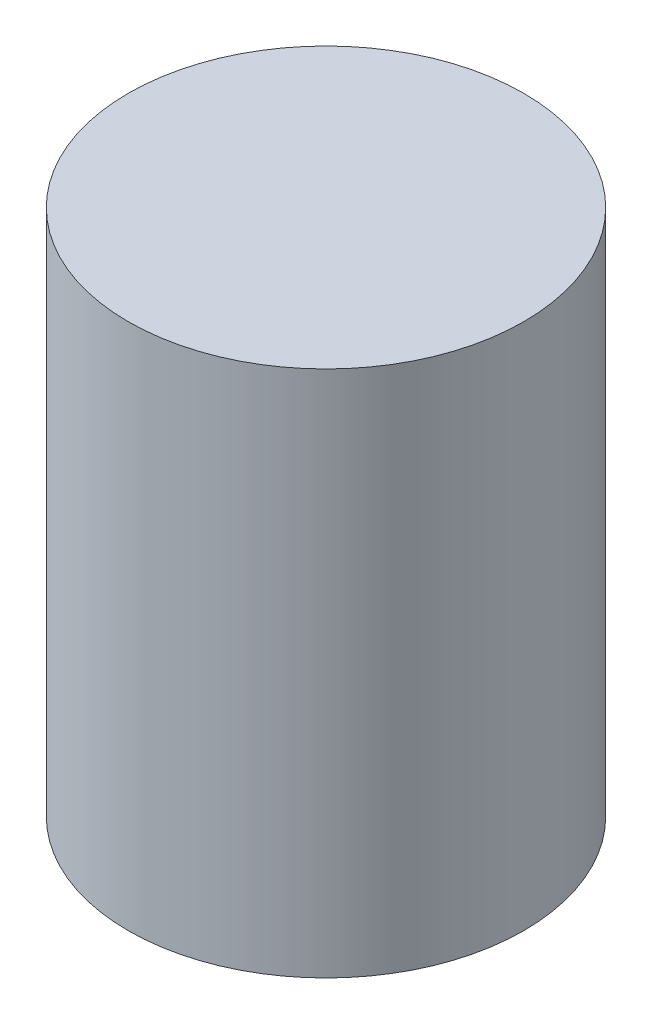
ISO-10303-21;
HEADER;
FILE_DESCRIPTION(('STEP AP214'),'2;1');
FILE_NAME('part.step','',(''),(''),'','','');
FILE_SCHEMA(('AUTOMOTIVE_DESIGN { 1 0 10303 214 1 1 1 1 }'));
ENDSEC;
DATA;
#1=APPLICATION_CONTEXT('core data for automotive mechanical design processes');
#2=APPLICATION_PROTOCOL_DEFINITION('international standard','automotive_design',2000,#1);
#3=PRODUCT_CONTEXT('',#1,'mechanical');
#4=PRODUCT('Part','Part','',(#3));
#5=PRODUCT_RELATED_PRODUCT_CATEGORY('part','',(#4));
#6=PRODUCT_DEFINITION_FORMATION('','',#4);
#7=PRODUCT_DEFINITION_CONTEXT('part definition',#1,'design');
#8=PRODUCT_DEFINITION('design','',#6,#7);
#9=PRODUCT_DEFINITION_SHAPE('','',#8);
#10=(LENGTH_UNIT() NAMED_UNIT(*) SI_UNIT(.MILLI.,.METRE.));
#11=(NAMED_UNIT(*) PLANE_ANGLE_UNIT() SI_UNIT($,.RADIAN.));
#12=(NAMED_UNIT(*) SI_UNIT($,.STERADIAN.) SOLID_ANGLE_UNIT());
#13=UNCERTAINTY_MEASURE_WITH_UNIT(LENGTH_MEASURE(1.E-05),#10,'distance_accuracy_value','');
#14=(GEOMETRIC_REPRESENTATION_CONTEXT(3) GLOBAL_UNCERTAINTY_ASSIGNED_CONTEXT((#13)) GLOBAL_UNIT_ASSIGNED_CONTEXT((#10,
#11,#12)) REPRESENTATION_CONTEXT('',''));
#15=CARTESIAN_POINT('',(0.,0.,0.));
#16=DIRECTION('',(0.,0.,1.));
#17=DIRECTION('',(1.,0.,0.));
#18=AXIS2_PLACEMENT_3D('',#15,#16,#17);
#19=CARTESIAN_POINT('',(0.,76.2,0.));
#20=DIRECTION('',(0.,-1.,0.));
#21=DIRECTION('',(0.,0.,-1.));
#22=AXIS2_PLACEMENT_3D('',#19,#20,#21);
#23=CYLINDRICAL_SURFACE('',#22,28.575);
#24=CARTESIAN_POINT('',(0.,76.2,0.));
#25=DIRECTION('',(0.,1.,0.));
#26=DIRECTION('',(0.,0.,1.));
#27=AXIS2_PLACEMENT_3D('',#24,#25,#26);
#28=CIRCLE('',#27,28.575);
#29=CARTESIAN_POINT('',(0.,76.2,28.575));
#30=VERTEX_POINT('',#29);
#31=EDGE_CURVE('E11',#30,#30,#28,.T.);
#32=ORIENTED_EDGE('',*,*,#31,.F.);
#33=EDGE_LOOP('',(#32));
#34=FACE_BOUND('',#33,.T.);
#35=CARTESIAN_POINT('',(0.,0.,0.));
#36=DIRECTION('',(0.,1.,0.));
#37=DIRECTION('',(0.,0.,1.));
#38=AXIS2_PLACEMENT_3D('',#35,#36,#37);
#39=CIRCLE('',#38,28.575);
#40=CARTESIAN_POINT('',(0.,0.,28.575));
#41=VERTEX_POINT('',#40);
#42=EDGE_CURVE('E41',#41,#41,#39,.T.);
#43=ORIENTED_EDGE('',*,*,#42,.T.);
#44=EDGE_LOOP('',(#43));
#45=FACE_BOUND('',#44,.T.);
#46=ADVANCED_FACE('F38',(#34,#45),#23,.T.);
#47=CARTESIAN_POINT('',(0.,76.2,0.));
#48=DIRECTION('',(0.,1.,0.));
#49=DIRECTION('',(0.,0.,1.));
#50=AXIS2_PLACEMENT_3D('',#47,#48,#49);
#51=PLANE('',#50);
#52=ORIENTED_EDGE('',*,*,#31,.T.);
#53=EDGE_LOOP('',(#52));
#54=FACE_BOUND('',#53,.T.);
#55=ADVANCED_FACE('F71',(#54),#51,.T.);
#56=CARTESIAN_POINT('',(0.,0.,0.));
#57=DIRECTION('',(0.,1.,0.));
#58=DIRECTION('',(0.,0.,1.));
#59=AXIS2_PLACEMENT_3D('',#56,#57,#58);
#60=PLANE('',#59);
#61=CARTESIAN_POINT('',(0.,0.,0.));
#62=DIRECTION('',(0.,-1.,0.));
#63=DIRECTION('',(0.,0.,-1.));
#64=AXIS2_PLACEMENT_3D('',#61,#62,#63);
#65=CIRCLE('',#64,5.35812999999999);
#66=CARTESIAN_POINT('',(0.,0.,-5.35812999999999));
#67=VERTEX_POINT('',#66);
#68=EDGE_CURVE('E59',#67,#67,#65,.T.);
#69=ORIENTED_EDGE('',*,*,#68,.F.);
#70=EDGE_LOOP('',(#69));
#71=FACE_BOUND('',#70,.T.);
#72=ORIENTED_EDGE('',*,*,#42,.F.);
#73=EDGE_LOOP('',(#72));
#74=FACE_BOUND('',#73,.T.);
#75=ADVANCED_FACE('F52',(#71,#74),#60,.F.);
#76=CARTESIAN_POINT('',(0.,40.,0.));
#77=DIRECTION('',(0.,-1.,0.));
#78=DIRECTION('',(0.,0.,-1.));
#79=AXIS2_PLACEMENT_3D('',#76,#77,#78);
#80=CONICAL_SURFACE('',#79,5.35812999999999,1.02974425867665);
#81=CARTESIAN_POINT('',(0.,43.2194893086302,0.));
#82=VERTEX_POINT('',#81);
#83=VERTEX_LOOP('',#82);
#84=FACE_BOUND('',#83,.T.);
#85=CARTESIAN_POINT('',(0.,40.,0.));
#86=DIRECTION('',(0.,-1.,0.));
#87=DIRECTION('',(0.,0.,-1.));
#88=AXIS2_PLACEMENT_3D('',#85,#86,#87);
#89=CIRCLE('',#88,5.35812999999999);
#90=CARTESIAN_POINT('',(0.,40.,-5.35812999999999));
#91=VERTEX_POINT('',#90);
#92=EDGE_CURVE('E56',#91,#91,#89,.T.);
#93=ORIENTED_EDGE('',*,*,#92,.T.);
#94=EDGE_LOOP('',(#93));
#95=FACE_BOUND('',#94,.T.);
#96=ADVANCED_FACE('F48',(#84,#95),#80,.F.);
#97=CARTESIAN_POINT('',(0.,0.,0.));
#98=DIRECTION('',(0.,-1.,0.));
#99=DIRECTION('',(0.,0.,-1.));
#100=AXIS2_PLACEMENT_3D('',#97,#98,#99);
#101=CYLINDRICAL_SURFACE('',#100,5.35812999999999);
#102=ORIENTED_EDGE('',*,*,#92,.F.);
#103=EDGE_LOOP('',(#102));
#104=FACE_BOUND('',#103,.T.);
#105=ORIENTED_EDGE('',*,*,#68,.T.);
#106=EDGE_LOOP('',(#105));
#107=FACE_BOUND('',#106,.T.);
#108=ADVANCED_FACE('F51',(#104,#107),#101,.F.);
#109=CLOSED_SHELL('',(#46,#55,#75,#96,#108));
#110=MANIFOLD_SOLID_BREP('B2',#109);
#111=ADVANCED_BREP_SHAPE_REPRESENTATION('',(#18,#110),#14);
#112=SHAPE_DEFINITION_REPRESENTATION(#9,#111);
ENDSEC;
END-ISO-10303-21;
